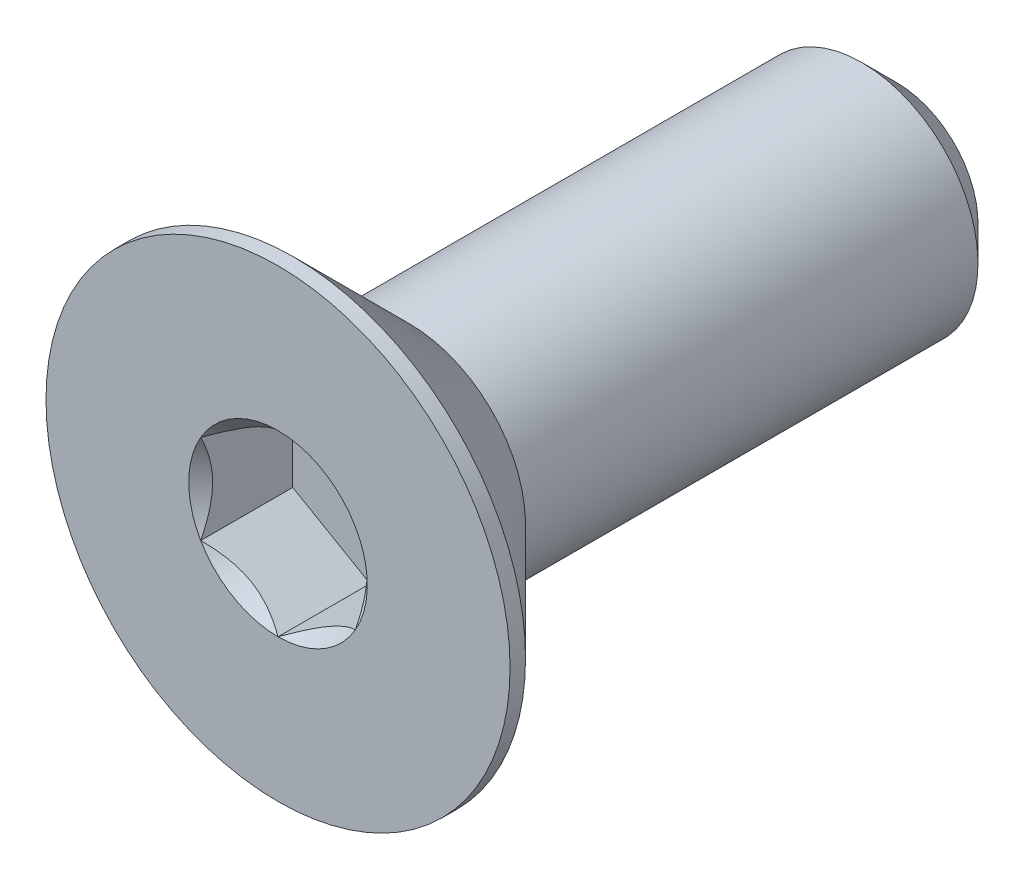
ISO-10303-21;
HEADER;
FILE_DESCRIPTION(('STEP AP214'),'2;1');
FILE_NAME('part.step','',(''),(''),'','','');
FILE_SCHEMA(('AUTOMOTIVE_DESIGN { 1 0 10303 214 1 1 1 1 }'));
ENDSEC;
DATA;
#1=APPLICATION_CONTEXT('core data for automotive mechanical design processes');
#2=APPLICATION_PROTOCOL_DEFINITION('international standard','automotive_design',2000,#1);
#3=PRODUCT_CONTEXT('',#1,'mechanical');
#4=PRODUCT('Part','Part','',(#3));
#5=PRODUCT_RELATED_PRODUCT_CATEGORY('part','',(#4));
#6=PRODUCT_DEFINITION_FORMATION('','',#4);
#7=PRODUCT_DEFINITION_CONTEXT('part definition',#1,'design');
#8=PRODUCT_DEFINITION('design','',#6,#7);
#9=PRODUCT_DEFINITION_SHAPE('','',#8);
#10=(LENGTH_UNIT() NAMED_UNIT(*) SI_UNIT(.MILLI.,.METRE.));
#11=(NAMED_UNIT(*) PLANE_ANGLE_UNIT() SI_UNIT($,.RADIAN.));
#12=(NAMED_UNIT(*) SI_UNIT($,.STERADIAN.) SOLID_ANGLE_UNIT());
#13=UNCERTAINTY_MEASURE_WITH_UNIT(LENGTH_MEASURE(1.E-05),#10,'distance_accuracy_value','');
#14=(GEOMETRIC_REPRESENTATION_CONTEXT(3) GLOBAL_UNCERTAINTY_ASSIGNED_CONTEXT((#13)) GLOBAL_UNIT_ASSIGNED_CONTEXT((#10,
#11,#12)) REPRESENTATION_CONTEXT('',''));
#15=CARTESIAN_POINT('',(0.,0.,0.));
#16=DIRECTION('',(0.,0.,1.));
#17=DIRECTION('',(1.,0.,0.));
#18=AXIS2_PLACEMENT_3D('',#15,#16,#17);
#19=CARTESIAN_POINT('',(0.,0.,-4.));
#20=DIRECTION('',(0.,0.,-1.));
#21=DIRECTION('',(0.,1.,0.));
#22=AXIS2_PLACEMENT_3D('',#19,#20,#21);
#23=CYLINDRICAL_SURFACE('',#22,1.5);
#24=CARTESIAN_POINT('',(0.,0.,2.3));
#25=DIRECTION('',(0.,0.,-1.));
#26=DIRECTION('',(0.,1.,0.));
#27=AXIS2_PLACEMENT_3D('',#24,#25,#26);
#28=CIRCLE('',#27,1.5);
#29=CARTESIAN_POINT('',(0.,1.5,2.3));
#30=VERTEX_POINT('',#29);
#31=EDGE_CURVE('E11',#30,#30,#28,.F.);
#32=ORIENTED_EDGE('',*,*,#31,.F.);
#33=EDGE_LOOP('',(#32));
#34=FACE_BOUND('',#33,.T.);
#35=CARTESIAN_POINT('',(0.,0.,-3.55));
#36=DIRECTION('',(0.,0.,-1.));
#37=DIRECTION('',(0.,1.,0.));
#38=AXIS2_PLACEMENT_3D('',#35,#36,#37);
#39=CIRCLE('',#38,1.5);
#40=CARTESIAN_POINT('',(0.,1.5,-3.55));
#41=VERTEX_POINT('',#40);
#42=EDGE_CURVE('E52',#41,#41,#39,.F.);
#43=ORIENTED_EDGE('',*,*,#42,.T.);
#44=EDGE_LOOP('',(#43));
#45=FACE_BOUND('',#44,.T.);
#46=ADVANCED_FACE('F43',(#34,#45),#23,.T.);
#47=CARTESIAN_POINT('',(0.,1.5,-4.));
#48=DIRECTION('',(0.,0.,-1.));
#49=DIRECTION('',(0.,1.,0.));
#50=AXIS2_PLACEMENT_3D('',#47,#48,#49);
#51=PLANE('',#50);
#52=CARTESIAN_POINT('',(0.,0.,-4.));
#53=DIRECTION('',(0.,0.,-1.));
#54=DIRECTION('',(0.,1.,0.));
#55=AXIS2_PLACEMENT_3D('',#52,#53,#54);
#56=CIRCLE('',#55,1.05);
#57=CARTESIAN_POINT('',(0.,1.05,-4.));
#58=VERTEX_POINT('',#57);
#59=EDGE_CURVE('E170',#58,#58,#56,.T.);
#60=ORIENTED_EDGE('',*,*,#59,.T.);
#61=EDGE_LOOP('',(#60));
#62=FACE_BOUND('',#61,.T.);
#63=ADVANCED_FACE('F182',(#62),#51,.T.);
#64=CARTESIAN_POINT('',(0.,0.,-4.));
#65=DIRECTION('',(0.,0.,1.));
#66=DIRECTION('',(0.,-1.,0.));
#67=AXIS2_PLACEMENT_3D('',#64,#65,#66);
#68=CONICAL_SURFACE('',#67,1.05,0.785398163397446);
#69=ORIENTED_EDGE('',*,*,#42,.F.);
#70=EDGE_LOOP('',(#69));
#71=FACE_BOUND('',#70,.T.);
#72=ORIENTED_EDGE('',*,*,#59,.F.);
#73=EDGE_LOOP('',(#72));
#74=FACE_BOUND('',#73,.T.);
#75=ADVANCED_FACE('F45',(#71,#74),#68,.T.);
#76=CARTESIAN_POINT('',(0.,0.,-4.));
#77=DIRECTION('',(0.,0.,-1.));
#78=DIRECTION('',(0.,1.,0.));
#79=AXIS2_PLACEMENT_3D('',#76,#77,#78);
#80=CYLINDRICAL_SURFACE('',#79,3.);
#81=CARTESIAN_POINT('',(0.,0.,4.));
#82=DIRECTION('',(0.,0.,-1.));
#83=DIRECTION('',(0.,1.,0.));
#84=AXIS2_PLACEMENT_3D('',#81,#82,#83);
#85=CIRCLE('',#84,3.);
#86=CARTESIAN_POINT('',(0.,3.,4.));
#87=VERTEX_POINT('',#86);
#88=EDGE_CURVE('E144',#87,#87,#85,.T.);
#89=ORIENTED_EDGE('',*,*,#88,.T.);
#90=EDGE_LOOP('',(#89));
#91=FACE_BOUND('',#90,.T.);
#92=CARTESIAN_POINT('',(0.,0.,3.8));
#93=DIRECTION('',(0.,0.,-1.));
#94=DIRECTION('',(0.,1.,0.));
#95=AXIS2_PLACEMENT_3D('',#92,#93,#94);
#96=CIRCLE('',#95,3.);
#97=CARTESIAN_POINT('',(0.,3.,3.8));
#98=VERTEX_POINT('',#97);
#99=EDGE_CURVE('E138',#98,#98,#96,.T.);
#100=ORIENTED_EDGE('',*,*,#99,.F.);
#101=EDGE_LOOP('',(#100));
#102=FACE_BOUND('',#101,.T.);
#103=ADVANCED_FACE('F181',(#91,#102),#80,.T.);
#104=CARTESIAN_POINT('',(0.,0.,2.3));
#105=DIRECTION('',(0.,0.,1.));
#106=DIRECTION('',(0.,-1.,0.));
#107=AXIS2_PLACEMENT_3D('',#104,#105,#106);
#108=CONICAL_SURFACE('',#107,1.5,0.78539816339745);
#109=ORIENTED_EDGE('',*,*,#99,.T.);
#110=EDGE_LOOP('',(#109));
#111=FACE_BOUND('',#110,.T.);
#112=ORIENTED_EDGE('',*,*,#31,.T.);
#113=EDGE_LOOP('',(#112));
#114=FACE_BOUND('',#113,.T.);
#115=ADVANCED_FACE('F194',(#111,#114),#108,.T.);
#116=CARTESIAN_POINT('',(0.,0.,4.));
#117=DIRECTION('',(0.,0.,1.));
#118=DIRECTION('',(0.,-1.,0.));
#119=AXIS2_PLACEMENT_3D('',#116,#117,#118);
#120=PLANE('',#119);
#121=CARTESIAN_POINT('',(0.,0.,4.));
#122=DIRECTION('',(0.,0.,1.));
#123=DIRECTION('',(1.,0.,0.));
#124=AXIS2_PLACEMENT_3D('',#121,#122,#123);
#125=CIRCLE('',#124,1.15470053837925);
#126=CARTESIAN_POINT('',(1.,0.577350269189632,4.));
#127=VERTEX_POINT('',#126);
#128=CARTESIAN_POINT('',(0.,1.15470053837926,4.));
#129=VERTEX_POINT('',#128);
#130=EDGE_CURVE('E103',#127,#129,#125,.T.);
#131=ORIENTED_EDGE('',*,*,#130,.F.);
#132=CARTESIAN_POINT('',(0.,0.,4.));
#133=DIRECTION('',(0.,0.,1.));
#134=DIRECTION('',(1.,0.,0.));
#135=AXIS2_PLACEMENT_3D('',#132,#133,#134);
#136=CIRCLE('',#135,1.15470053837925);
#137=CARTESIAN_POINT('',(0.999999999999989,-0.577350269189633,4.));
#138=VERTEX_POINT('',#137);
#139=EDGE_CURVE('E116',#138,#127,#136,.T.);
#140=ORIENTED_EDGE('',*,*,#139,.F.);
#141=CARTESIAN_POINT('',(0.,0.,4.));
#142=DIRECTION('',(0.,0.,1.));
#143=DIRECTION('',(1.,0.,0.));
#144=AXIS2_PLACEMENT_3D('',#141,#142,#143);
#145=CIRCLE('',#144,1.15470053837925);
#146=CARTESIAN_POINT('',(0.,-1.15470053837924,4.));
#147=VERTEX_POINT('',#146);
#148=EDGE_CURVE('E271',#147,#138,#145,.T.);
#149=ORIENTED_EDGE('',*,*,#148,.F.);
#150=CARTESIAN_POINT('',(0.,0.,4.));
#151=DIRECTION('',(0.,0.,1.));
#152=DIRECTION('',(1.,0.,0.));
#153=AXIS2_PLACEMENT_3D('',#150,#151,#152);
#154=CIRCLE('',#153,1.15470053837925);
#155=CARTESIAN_POINT('',(-1.,-0.577350269189614,4.));
#156=VERTEX_POINT('',#155);
#157=EDGE_CURVE('E132',#156,#147,#154,.T.);
#158=ORIENTED_EDGE('',*,*,#157,.F.);
#159=CARTESIAN_POINT('',(0.,0.,4.));
#160=DIRECTION('',(0.,0.,1.));
#161=DIRECTION('',(1.,0.,0.));
#162=AXIS2_PLACEMENT_3D('',#159,#160,#161);
#163=CIRCLE('',#162,1.15470053837925);
#164=CARTESIAN_POINT('',(-1.,0.577350269189624,4.));
#165=VERTEX_POINT('',#164);
#166=EDGE_CURVE('E272',#165,#156,#163,.T.);
#167=ORIENTED_EDGE('',*,*,#166,.F.);
#168=CARTESIAN_POINT('',(0.,0.,4.));
#169=DIRECTION('',(0.,0.,1.));
#170=DIRECTION('',(1.,0.,0.));
#171=AXIS2_PLACEMENT_3D('',#168,#169,#170);
#172=CIRCLE('',#171,1.15470053837925);
#173=EDGE_CURVE('E119',#129,#165,#172,.T.);
#174=ORIENTED_EDGE('',*,*,#173,.F.);
#175=EDGE_LOOP('',(#131,#140,#149,#158,#167,#174));
#176=FACE_BOUND('',#175,.T.);
#177=ORIENTED_EDGE('',*,*,#88,.F.);
#178=EDGE_LOOP('',(#177));
#179=FACE_BOUND('',#178,.T.);
#180=ADVANCED_FACE('F113',(#176,#179),#120,.T.);
#181=CARTESIAN_POINT('',(1.,0.577350269189626,2.81));
#182=DIRECTION('',(0.5,0.866025403784438,0.));
#183=DIRECTION('',(-0.866025403784439,0.5,0.));
#184=AXIS2_PLACEMENT_3D('',#181,#182,#183);
#185=PLANE('',#184);
#186=DIRECTION('',(0.,0.,1.));
#187=VECTOR('',#186,1.);
#188=CARTESIAN_POINT('',(1.,0.577350269189626,2.81));
#189=LINE('',#188,#187);
#190=CARTESIAN_POINT('',(1.,0.577350269189626,2.81));
#191=VERTEX_POINT('',#190);
#192=EDGE_CURVE('E59',#191,#127,#189,.T.);
#193=ORIENTED_EDGE('',*,*,#192,.T.);
#194=CARTESIAN_POINT('',(-0.000199999999999858,1.15481600843309,4.00011548737261));
#195=CARTESIAN_POINT('',(0.0341825950071804,1.13496520795026,3.98027793082573));
#196=CARTESIAN_POINT('',(0.0691401181398244,1.11478247255942,3.96160502063888));
#197=CARTESIAN_POINT('',(0.140422802956089,1.07362739529219,3.92741474272315));
#198=CARTESIAN_POINT('',(0.176754750528983,1.0526511355808,3.91191640902345));
#199=CARTESIAN_POINT('',(0.25001661380331,1.01035337909803,3.88536730714226));
#200=CARTESIAN_POINT('',(0.286927851445413,0.989042666109242,3.87424977399692));
#201=CARTESIAN_POINT('',(0.361562729310857,0.945952199282693,3.85711986577618));
#202=CARTESIAN_POINT('',(0.399284088108633,0.924173762626598,3.85109469746667));
#203=CARTESIAN_POINT('',(0.464292198417931,0.886641312640016,3.84566055496749));
#204=CARTESIAN_POINT('',(0.491494371528169,0.870936130672278,3.84485693831673));
#205=CARTESIAN_POINT('',(0.545846040669109,0.839556179862851,3.84620669941688));
#206=CARTESIAN_POINT('',(0.572995523754872,0.823881418494926,3.84836072954719));
#207=CARTESIAN_POINT('',(0.654056277326956,0.777080970599369,3.85911697212847));
#208=CARTESIAN_POINT('',(0.707564140978423,0.746188191116433,3.87201455641535));
#209=CARTESIAN_POINT('',(0.801476065143428,0.691968116419652,3.90314073060217));
#210=CARTESIAN_POINT('',(0.842320523671831,0.668386557293374,3.91973779770183));
#211=CARTESIAN_POINT('',(0.922409637381942,0.622147085933683,3.95712492468529));
#212=CARTESIAN_POINT('',(0.961659010870436,0.599486449584576,3.9779013418174));
#213=CARTESIAN_POINT('',(1.0002,0.577234799135789,4.00011548737261));
#214=B_SPLINE_CURVE_WITH_KNOTS('',3,(#194,#195,#196,#197,#198,#199,#200,#201,#202,#203,#204,
#205,#206,#207,#208,#209,#210,#211,#212,#213),.UNSPECIFIED.,.F.,.F.,(4,2,2,2,2,2,2,2,2,4),(0.,
0.133237676828559,0.267252229834489,0.399137076269298,0.530689603280765,0.624814864263842,
0.718960890149129,0.907306626112092,1.05710100361789,1.20641411519286),.UNSPECIFIED.);
#215=EDGE_CURVE('E100',#129,#127,#214,.T.);
#216=ORIENTED_EDGE('',*,*,#215,.F.);
#217=DIRECTION('',(0.,0.,1.));
#218=VECTOR('',#217,1.);
#219=CARTESIAN_POINT('',(0.,1.15470053837925,2.81));
#220=LINE('',#219,#218);
#221=CARTESIAN_POINT('',(0.,1.15470053837925,2.81));
#222=VERTEX_POINT('',#221);
#223=EDGE_CURVE('E164',#222,#129,#220,.T.);
#224=ORIENTED_EDGE('',*,*,#223,.F.);
#225=DIRECTION('',(-0.866025403784439,0.5,0.));
#226=VECTOR('',#225,1.);
#227=CARTESIAN_POINT('',(1.,0.577350269189626,2.81));
#228=LINE('',#227,#226);
#229=EDGE_CURVE('E128',#191,#222,#228,.T.);
#230=ORIENTED_EDGE('',*,*,#229,.F.);
#231=EDGE_LOOP('',(#193,#216,#224,#230));
#232=FACE_BOUND('',#231,.T.);
#233=ADVANCED_FACE('F134',(#232),#185,.F.);
#234=CARTESIAN_POINT('',(1.,-0.577350269189627,2.81));
#235=DIRECTION('',(1.,0.,0.));
#236=DIRECTION('',(0.,0.,-1.));
#237=AXIS2_PLACEMENT_3D('',#234,#235,#236);
#238=PLANE('',#237);
#239=DIRECTION('',(0.,0.,1.));
#240=VECTOR('',#239,1.);
#241=CARTESIAN_POINT('',(1.,-0.577350269189627,2.81));
#242=LINE('',#241,#240);
#243=CARTESIAN_POINT('',(1.,-0.577350269189627,2.81));
#244=VERTEX_POINT('',#243);
#245=EDGE_CURVE('E67',#244,#138,#242,.T.);
#246=ORIENTED_EDGE('',*,*,#245,.T.);
#247=CARTESIAN_POINT('',(1.,-1.15147208646463,4.37038567751387));
#248=CARTESIAN_POINT('',(1.,-1.12343447988553,4.34921991987373));
#249=CARTESIAN_POINT('',(1.,-1.09524064850698,4.32826169217592));
#250=CARTESIAN_POINT('',(1.,-1.03847715644377,4.28684602223563));
#251=CARTESIAN_POINT('',(1.,-1.00990740382976,4.26638870612367));
#252=CARTESIAN_POINT('',(1.,-0.923120894333482,4.20560479495452));
#253=CARTESIAN_POINT('',(1.,-0.864253173759065,4.16619222896141));
#254=CARTESIAN_POINT('',(1.,-0.740809858258049,4.08882066420021));
#255=CARTESIAN_POINT('',(1.,-0.676100255137809,4.05107303911435));
#256=CARTESIAN_POINT('',(1.,-0.543448939049125,3.9820245875513));
#257=CARTESIAN_POINT('',(1.,-0.475519112027778,3.95070202784687));
#258=CARTESIAN_POINT('',(1.,-0.373555850333527,3.9123817788838));
#259=CARTESIAN_POINT('',(1.,-0.341031989670906,3.90138359164216));
#260=CARTESIAN_POINT('',(1.,-0.275199079052291,3.88199834214736));
#261=CARTESIAN_POINT('',(1.,-0.24188997517393,3.8736114597767));
#262=CARTESIAN_POINT('',(1.,-0.17524751704299,3.86002522071902));
#263=CARTESIAN_POINT('',(1.,-0.141925568218172,3.85477079076797));
#264=CARTESIAN_POINT('',(1.,-0.0749144362322751,3.84754868657089));
#265=CARTESIAN_POINT('',(1.,-0.0412251978501576,3.84558151361051));
#266=CARTESIAN_POINT('',(1.,0.0249580992634257,3.84508319839316));
#267=CARTESIAN_POINT('',(1.,0.0574512826460442,3.84643026788864));
#268=CARTESIAN_POINT('',(1.,0.122148505701872,3.85221648449899));
#269=CARTESIAN_POINT('',(1.,0.154352610132932,3.85665492066154));
#270=CARTESIAN_POINT('',(1.,0.218799898867646,3.8684568301452));
#271=CARTESIAN_POINT('',(1.,0.25103374326896,3.87587054103851));
#272=CARTESIAN_POINT('',(1.,0.314797132354926,3.89322894249868));
#273=CARTESIAN_POINT('',(1.,0.346326735731011,3.90317342128883));
#274=CARTESIAN_POINT('',(1.,0.445594187730212,3.93822348255434));
#275=CARTESIAN_POINT('',(1.,0.511919139476043,3.96732085835672));
#276=CARTESIAN_POINT('',(1.,0.641453244657538,4.0320153296865));
#277=CARTESIAN_POINT('',(1.,0.70465013312635,4.06763577671524));
#278=CARTESIAN_POINT('',(1.,0.825428490174992,4.14112390134693));
#279=CARTESIAN_POINT('',(1.,0.883132947867689,4.17879194713546));
#280=CARTESIAN_POINT('',(1.,0.96814885370457,4.23702285294316));
#281=CARTESIAN_POINT('',(1.,0.996120570380289,4.25663847576285));
#282=CARTESIAN_POINT('',(1.,1.05168177729902,4.29638851706127));
#283=CARTESIAN_POINT('',(1.,1.07927136997701,4.31652279219883));
#284=CARTESIAN_POINT('',(1.,1.1067018534633,4.33687211907297));
#285=B_SPLINE_CURVE_WITH_KNOTS('',3,(#247,#248,#249,#250,#251,#252,#253,#254,#255,#256,#257,
#258,#259,#260,#261,#262,#263,#264,#265,#266,#267,#268,#269,#270,#271,#272,#273,#274,#275,#276,
#277,#278,#279,#280,#281,#282,#283,#284),.UNSPECIFIED.,.F.,.F.,(4,2,2,2,2,2,2,2,2,2,2,2,2,2,2,2,
2,2,4),(0.,0.105386459083291,0.210799187330127,0.423233611565475,0.647793540908513,
0.871580877738623,0.974493074181435,1.07741235827203,1.17846428203206,1.27953161415764,
1.37694086739612,1.4743277258541,1.57343322804295,1.67253043972853,1.88917353996829,
2.10660791038815,2.31323734249845,2.41572589232046,2.51818641476505),.UNSPECIFIED.);
#286=EDGE_CURVE('E126',#127,#138,#285,.F.);
#287=ORIENTED_EDGE('',*,*,#286,.F.);
#288=ORIENTED_EDGE('',*,*,#192,.F.);
#289=DIRECTION('',(0.,1.,0.));
#290=VECTOR('',#289,1.);
#291=CARTESIAN_POINT('',(1.,-0.577350269189627,2.81));
#292=LINE('',#291,#290);
#293=EDGE_CURVE('E150',#244,#191,#292,.T.);
#294=ORIENTED_EDGE('',*,*,#293,.F.);
#295=EDGE_LOOP('',(#246,#287,#288,#294));
#296=FACE_BOUND('',#295,.T.);
#297=ADVANCED_FACE('F130',(#296),#238,.F.);
#298=CARTESIAN_POINT('',(0.,-1.15470053837925,2.81));
#299=DIRECTION('',(0.5,-0.866025403784439,0.));
#300=DIRECTION('',(0.866025403784439,0.5,0.));
#301=AXIS2_PLACEMENT_3D('',#298,#299,#300);
#302=PLANE('',#301);
#303=DIRECTION('',(0.,0.,1.));
#304=VECTOR('',#303,1.);
#305=CARTESIAN_POINT('',(0.,-1.15470053837925,2.81));
#306=LINE('',#305,#304);
#307=CARTESIAN_POINT('',(0.,-1.15470053837925,2.81));
#308=VERTEX_POINT('',#307);
#309=EDGE_CURVE('E147',#308,#147,#306,.T.);
#310=ORIENTED_EDGE('',*,*,#309,.T.);
#311=CARTESIAN_POINT('',(1.0002,-0.577234799135789,4.00011548737262));
#312=CARTESIAN_POINT('',(0.965817404992819,-0.597085599618622,3.98027793082574));
#313=CARTESIAN_POINT('',(0.930859881860175,-0.617268335009457,3.9616050206389));
#314=CARTESIAN_POINT('',(0.859577197043911,-0.658423412276686,3.92741474272317));
#315=CARTESIAN_POINT('',(0.823245249471016,-0.67939967198808,3.91191640902347));
#316=CARTESIAN_POINT('',(0.74998338619669,-0.721697428470846,3.88536730714227));
#317=CARTESIAN_POINT('',(0.713072148554587,-0.743008141459637,3.87424977399693));
#318=CARTESIAN_POINT('',(0.638437270689142,-0.786098608286186,3.85711986577619));
#319=CARTESIAN_POINT('',(0.600715911891366,-0.80787704494228,3.85109469746668));
#320=CARTESIAN_POINT('',(0.535707801582068,-0.845409494928862,3.8456605549675));
#321=CARTESIAN_POINT('',(0.508505628471829,-0.861114676896601,3.84485693831674));
#322=CARTESIAN_POINT('',(0.454153959330889,-0.892494627706029,3.8462066994169));
#323=CARTESIAN_POINT('',(0.427004476245125,-0.908169389073954,3.84836072954721));
#324=CARTESIAN_POINT('',(0.34594372267304,-0.954969836969511,3.85911697212848));
#325=CARTESIAN_POINT('',(0.292435859021573,-0.985862616452447,3.87201455641537));
#326=CARTESIAN_POINT('',(0.198523934856568,-1.04008269114923,3.90314073060219));
#327=CARTESIAN_POINT('',(0.157679476328166,-1.06366425027551,3.91973779770185));
#328=CARTESIAN_POINT('',(0.0775903626180562,-1.1099037216352,3.9571249246853));
#329=CARTESIAN_POINT('',(0.0383409891295622,-1.1325643579843,3.97790134181741));
#330=CARTESIAN_POINT('',(-0.000199999999999848,-1.15481600843309,4.00011548737262));
#331=B_SPLINE_CURVE_WITH_KNOTS('',3,(#311,#312,#313,#314,#315,#316,#317,#318,#319,#320,#321,
#322,#323,#324,#325,#326,#327,#328,#329,#330),.UNSPECIFIED.,.F.,.F.,(4,2,2,2,2,2,2,2,2,4),(0.,
0.133237676828558,0.267252229834488,0.399137076269297,0.530689603280765,0.624814864263843,
0.718960890149131,0.907306626112096,1.05710100361789,1.20641411519286),.UNSPECIFIED.);
#332=EDGE_CURVE('E268',#138,#147,#331,.T.);
#333=ORIENTED_EDGE('',*,*,#332,.F.);
#334=ORIENTED_EDGE('',*,*,#245,.F.);
#335=DIRECTION('',(0.866025403784439,0.5,0.));
#336=VECTOR('',#335,1.);
#337=CARTESIAN_POINT('',(0.,-1.15470053837925,2.81));
#338=LINE('',#337,#336);
#339=EDGE_CURVE('E258',#308,#244,#338,.T.);
#340=ORIENTED_EDGE('',*,*,#339,.F.);
#341=EDGE_LOOP('',(#310,#333,#334,#340));
#342=FACE_BOUND('',#341,.T.);
#343=ADVANCED_FACE('F217',(#342),#302,.F.);
#344=CARTESIAN_POINT('',(-1.,-0.577350269189626,2.81));
#345=DIRECTION('',(-0.5,-0.866025403784439,0.));
#346=DIRECTION('',(0.866025403784439,-0.5,0.));
#347=AXIS2_PLACEMENT_3D('',#344,#345,#346);
#348=PLANE('',#347);
#349=DIRECTION('',(0.,0.,1.));
#350=VECTOR('',#349,1.);
#351=CARTESIAN_POINT('',(-1.,-0.577350269189626,2.81));
#352=LINE('',#351,#350);
#353=CARTESIAN_POINT('',(-1.,-0.577350269189626,2.81));
#354=VERTEX_POINT('',#353);
#355=EDGE_CURVE('E156',#354,#156,#352,.T.);
#356=ORIENTED_EDGE('',*,*,#355,.T.);
#357=CARTESIAN_POINT('',(0.000199999999999887,-1.15481600843309,4.00011548737262));
#358=CARTESIAN_POINT('',(-0.0341825950071811,-1.13496520795026,3.98027793082574));
#359=CARTESIAN_POINT('',(-0.0691401181398256,-1.11478247255942,3.9616050206389));
#360=CARTESIAN_POINT('',(-0.140422802956091,-1.07362739529219,3.92741474272317));
#361=CARTESIAN_POINT('',(-0.176754750528986,-1.0526511355808,3.91191640902347));
#362=CARTESIAN_POINT('',(-0.250016613803313,-1.01035337909803,3.88536730714227));
#363=CARTESIAN_POINT('',(-0.286927851445417,-0.98904266610924,3.87424977399694));
#364=CARTESIAN_POINT('',(-0.361562729310862,-0.94595219928269,3.85711986577619));
#365=CARTESIAN_POINT('',(-0.399284088108639,-0.924173762626595,3.85109469746668));
#366=CARTESIAN_POINT('',(-0.464292198417937,-0.886641312640012,3.8456605549675));
#367=CARTESIAN_POINT('',(-0.491494371528176,-0.870936130672273,3.84485693831674));
#368=CARTESIAN_POINT('',(-0.545846040669117,-0.839556179862846,3.8462066994169));
#369=CARTESIAN_POINT('',(-0.57299552375488,-0.823881418494921,3.84836072954721));
#370=CARTESIAN_POINT('',(-0.654056277326966,-0.777080970599364,3.85911697212848));
#371=CARTESIAN_POINT('',(-0.707564140978433,-0.746188191116427,3.87201455641537));
#372=CARTESIAN_POINT('',(-0.801476065143437,-0.691968116419646,3.90314073060219));
#373=CARTESIAN_POINT('',(-0.842320523671838,-0.668386557293369,3.91973779770185));
#374=CARTESIAN_POINT('',(-0.922409637381946,-0.62214708593368,3.9571249246853));
#375=CARTESIAN_POINT('',(-0.961659010870439,-0.599486449584575,3.97790134181741));
#376=CARTESIAN_POINT('',(-1.0002,-0.577234799135788,4.00011548737262));
#377=B_SPLINE_CURVE_WITH_KNOTS('',3,(#357,#358,#359,#360,#361,#362,#363,#364,#365,#366,#367,
#368,#369,#370,#371,#372,#373,#374,#375,#376),.UNSPECIFIED.,.F.,.F.,(4,2,2,2,2,2,2,2,2,4),(0.,
0.13323767682856,0.267252229834492,0.399137076269303,0.530689603280773,0.624814864263851,
0.718960890149139,0.907306626112105,1.0571010036179,1.20641411519286),.UNSPECIFIED.);
#378=EDGE_CURVE('E235',#147,#156,#377,.T.);
#379=ORIENTED_EDGE('',*,*,#378,.F.);
#380=ORIENTED_EDGE('',*,*,#309,.F.);
#381=DIRECTION('',(0.866025403784439,-0.5,0.));
#382=VECTOR('',#381,1.);
#383=CARTESIAN_POINT('',(-1.,-0.577350269189626,2.81));
#384=LINE('',#383,#382);
#385=EDGE_CURVE('E255',#354,#308,#384,.T.);
#386=ORIENTED_EDGE('',*,*,#385,.F.);
#387=EDGE_LOOP('',(#356,#379,#380,#386));
#388=FACE_BOUND('',#387,.T.);
#389=ADVANCED_FACE('F213',(#388),#348,.F.);
#390=CARTESIAN_POINT('',(-1.,0.577350269189626,2.81));
#391=DIRECTION('',(-1.,0.,0.));
#392=DIRECTION('',(0.,-1.,0.));
#393=AXIS2_PLACEMENT_3D('',#390,#391,#392);
#394=PLANE('',#393);
#395=DIRECTION('',(0.,0.,1.));
#396=VECTOR('',#395,1.);
#397=CARTESIAN_POINT('',(-1.,0.577350269189626,2.81));
#398=LINE('',#397,#396);
#399=CARTESIAN_POINT('',(-1.,0.577350269189626,2.81));
#400=VERTEX_POINT('',#399);
#401=EDGE_CURVE('E160',#400,#165,#398,.T.);
#402=ORIENTED_EDGE('',*,*,#401,.T.);
#403=CARTESIAN_POINT('',(-1.,-1.15147208646462,4.37038567751387));
#404=CARTESIAN_POINT('',(-1.,-1.12343447988552,4.34921991987372));
#405=CARTESIAN_POINT('',(-1.,-1.09524064850698,4.32826169217592));
#406=CARTESIAN_POINT('',(-1.,-1.03847715644377,4.28684602223563));
#407=CARTESIAN_POINT('',(-1.,-1.00990740382975,4.26638870612367));
#408=CARTESIAN_POINT('',(-1.,-0.92312089433348,4.20560479495452));
#409=CARTESIAN_POINT('',(-1.,-0.864253173759062,4.16619222896141));
#410=CARTESIAN_POINT('',(-1.,-0.740809858258047,4.08882066420021));
#411=CARTESIAN_POINT('',(-1.,-0.676100255137807,4.05107303911435));
#412=CARTESIAN_POINT('',(-1.,-0.543448939049123,3.9820245875513));
#413=CARTESIAN_POINT('',(-1.,-0.475519112027777,3.95070202784687));
#414=CARTESIAN_POINT('',(-1.,-0.373555850333526,3.9123817788838));
#415=CARTESIAN_POINT('',(-1.,-0.341031989670905,3.90138359164216));
#416=CARTESIAN_POINT('',(-1.,-0.27519907905229,3.88199834214736));
#417=CARTESIAN_POINT('',(-1.,-0.241889975173929,3.8736114597767));
#418=CARTESIAN_POINT('',(-1.,-0.175247517042989,3.86002522071902));
#419=CARTESIAN_POINT('',(-1.,-0.141925568218171,3.85477079076797));
#420=CARTESIAN_POINT('',(-1.,-0.0749144362322745,3.84754868657089));
#421=CARTESIAN_POINT('',(-1.,-0.0412251978501571,3.84558151361051));
#422=CARTESIAN_POINT('',(-1.,0.0249580992634261,3.84508319839316));
#423=CARTESIAN_POINT('',(-1.,0.0574512826460445,3.84643026788864));
#424=CARTESIAN_POINT('',(-1.,0.122148505701872,3.85221648449899));
#425=CARTESIAN_POINT('',(-1.,0.154352610132932,3.85665492066154));
#426=CARTESIAN_POINT('',(-1.,0.218799898867646,3.8684568301452));
#427=CARTESIAN_POINT('',(-1.,0.25103374326896,3.87587054103851));
#428=CARTESIAN_POINT('',(-1.,0.314797132354926,3.89322894249868));
#429=CARTESIAN_POINT('',(-1.,0.346326735731012,3.90317342128883));
#430=CARTESIAN_POINT('',(-1.,0.445594187730212,3.93822348255434));
#431=CARTESIAN_POINT('',(-1.,0.511919139476043,3.96732085835672));
#432=CARTESIAN_POINT('',(-1.,0.641453244657538,4.03201532968651));
#433=CARTESIAN_POINT('',(-1.,0.70465013312635,4.06763577671524));
#434=CARTESIAN_POINT('',(-1.,0.825428490174992,4.14112390134693));
#435=CARTESIAN_POINT('',(-1.,0.88313294786769,4.17879194713546));
#436=CARTESIAN_POINT('',(-1.,0.96814885370457,4.23702285294316));
#437=CARTESIAN_POINT('',(-1.,0.99612057038029,4.25663847576285));
#438=CARTESIAN_POINT('',(-1.,1.05168177729902,4.29638851706127));
#439=CARTESIAN_POINT('',(-1.,1.07927136997701,4.31652279219883));
#440=CARTESIAN_POINT('',(-1.,1.1067018534633,4.33687211907297));
#441=B_SPLINE_CURVE_WITH_KNOTS('',3,(#403,#404,#405,#406,#407,#408,#409,#410,#411,#412,#413,
#414,#415,#416,#417,#418,#419,#420,#421,#422,#423,#424,#425,#426,#427,#428,#429,#430,#431,#432,
#433,#434,#435,#436,#437,#438,#439,#440),.UNSPECIFIED.,.F.,.F.,(4,2,2,2,2,2,2,2,2,2,2,2,2,2,2,2,
2,2,4),(0.,0.105386459083292,0.210799187330127,0.423233611565474,0.647793540908512,
0.871580877738621,0.974493074181433,1.07741235827202,1.17846428203206,1.27953161415764,
1.37694086739612,1.47432772585409,1.57343322804295,1.67253043972853,1.88917353996829,
2.10660791038814,2.31323734249845,2.41572589232046,2.51818641476504),.UNSPECIFIED.);
#442=EDGE_CURVE('E107',#156,#165,#441,.T.);
#443=ORIENTED_EDGE('',*,*,#442,.F.);
#444=ORIENTED_EDGE('',*,*,#355,.F.);
#445=DIRECTION('',(0.,-1.,0.));
#446=VECTOR('',#445,1.);
#447=CARTESIAN_POINT('',(-1.,0.577350269189626,2.81));
#448=LINE('',#447,#446);
#449=EDGE_CURVE('E251',#400,#354,#448,.T.);
#450=ORIENTED_EDGE('',*,*,#449,.F.);
#451=EDGE_LOOP('',(#402,#443,#444,#450));
#452=FACE_BOUND('',#451,.T.);
#453=ADVANCED_FACE('F209',(#452),#394,.F.);
#454=CARTESIAN_POINT('',(0.,1.15470053837925,2.81));
#455=DIRECTION('',(-0.5,0.866025403784439,0.));
#456=DIRECTION('',(-0.866025403784439,-0.5,0.));
#457=AXIS2_PLACEMENT_3D('',#454,#455,#456);
#458=PLANE('',#457);
#459=ORIENTED_EDGE('',*,*,#223,.T.);
#460=CARTESIAN_POINT('',(-1.0002,0.577234799135788,4.00011548737261));
#461=CARTESIAN_POINT('',(-0.965817404992819,0.597085599618622,3.98027793082573));
#462=CARTESIAN_POINT('',(-0.930859881860175,0.617268335009457,3.96160502063889));
#463=CARTESIAN_POINT('',(-0.859577197043909,0.658423412276687,3.92741474272315));
#464=CARTESIAN_POINT('',(-0.823245249471015,0.679399671988081,3.91191640902345));
#465=CARTESIAN_POINT('',(-0.749983386196687,0.721697428470848,3.88536730714226));
#466=CARTESIAN_POINT('',(-0.713072148554584,0.743008141459638,3.87424977399692));
#467=CARTESIAN_POINT('',(-0.638437270689138,0.786098608286188,3.85711986577618));
#468=CARTESIAN_POINT('',(-0.600715911891362,0.807877044942283,3.85109469746667));
#469=CARTESIAN_POINT('',(-0.535707801582064,0.845409494928865,3.84566055496749));
#470=CARTESIAN_POINT('',(-0.508505628471825,0.861114676896604,3.84485693831673));
#471=CARTESIAN_POINT('',(-0.454153959330886,0.892494627706031,3.84620669941688));
#472=CARTESIAN_POINT('',(-0.427004476245122,0.908169389073955,3.84836072954719));
#473=CARTESIAN_POINT('',(-0.345943722673038,0.954969836969512,3.85911697212847));
#474=CARTESIAN_POINT('',(-0.292435859021571,0.985862616452448,3.87201455641535));
#475=CARTESIAN_POINT('',(-0.198523934856568,1.04008269114923,3.90314073060217));
#476=CARTESIAN_POINT('',(-0.157679476328165,1.06366425027551,3.91973779770183));
#477=CARTESIAN_POINT('',(-0.077590362618056,1.1099037216352,3.95712492468529));
#478=CARTESIAN_POINT('',(-0.0383409891295618,1.1325643579843,3.9779013418174));
#479=CARTESIAN_POINT('',(0.000200000000000454,1.15481600843309,4.00011548737261));
#480=B_SPLINE_CURVE_WITH_KNOTS('',3,(#460,#461,#462,#463,#464,#465,#466,#467,#468,#469,#470,
#471,#472,#473,#474,#475,#476,#477,#478,#479),.UNSPECIFIED.,.F.,.F.,(4,2,2,2,2,2,2,2,2,4),(0.,
0.13323767682856,0.267252229834492,0.399137076269303,0.530689603280772,0.624814864263849,
0.718960890149136,0.907306626112099,1.05710100361789,1.20641411519286),.UNSPECIFIED.);
#481=EDGE_CURVE('E264',#165,#129,#480,.T.);
#482=ORIENTED_EDGE('',*,*,#481,.F.);
#483=ORIENTED_EDGE('',*,*,#401,.F.);
#484=DIRECTION('',(-0.866025403784439,-0.5,0.));
#485=VECTOR('',#484,1.);
#486=CARTESIAN_POINT('',(0.,1.15470053837925,2.81));
#487=LINE('',#486,#485);
#488=EDGE_CURVE('E247',#222,#400,#487,.T.);
#489=ORIENTED_EDGE('',*,*,#488,.F.);
#490=EDGE_LOOP('',(#459,#482,#483,#489));
#491=FACE_BOUND('',#490,.T.);
#492=ADVANCED_FACE('F205',(#491),#458,.F.);
#493=CARTESIAN_POINT('',(0.,0.,2.81));
#494=DIRECTION('',(0.,0.,1.));
#495=DIRECTION('',(1.,0.,0.));
#496=AXIS2_PLACEMENT_3D('',#493,#494,#495);
#497=PLANE('',#496);
#498=ORIENTED_EDGE('',*,*,#229,.T.);
#499=ORIENTED_EDGE('',*,*,#488,.T.);
#500=ORIENTED_EDGE('',*,*,#449,.T.);
#501=ORIENTED_EDGE('',*,*,#385,.T.);
#502=ORIENTED_EDGE('',*,*,#339,.T.);
#503=ORIENTED_EDGE('',*,*,#293,.T.);
#504=EDGE_LOOP('',(#498,#499,#500,#501,#502,#503));
#505=FACE_BOUND('',#504,.T.);
#506=ADVANCED_FACE('F208',(#505),#497,.T.);
#507=CARTESIAN_POINT('',(0.,0.,4.));
#508=DIRECTION('',(0.,0.,1.));
#509=DIRECTION('',(1.,0.,0.));
#510=AXIS2_PLACEMENT_3D('',#507,#508,#509);
#511=CONICAL_SURFACE('',#510,1.15470053837925,0.78539816339745);
#512=ORIENTED_EDGE('',*,*,#481,.T.);
#513=ORIENTED_EDGE('',*,*,#173,.T.);
#514=EDGE_LOOP('',(#512,#513));
#515=FACE_BOUND('',#514,.T.);
#516=ADVANCED_FACE('F225',(#515),#511,.F.);
#517=CARTESIAN_POINT('',(0.,0.,4.));
#518=DIRECTION('',(0.,0.,1.));
#519=DIRECTION('',(1.,0.,0.));
#520=AXIS2_PLACEMENT_3D('',#517,#518,#519);
#521=CONICAL_SURFACE('',#520,1.15470053837925,0.78539816339745);
#522=ORIENTED_EDGE('',*,*,#378,.T.);
#523=ORIENTED_EDGE('',*,*,#157,.T.);
#524=EDGE_LOOP('',(#522,#523));
#525=FACE_BOUND('',#524,.T.);
#526=ADVANCED_FACE('F227',(#525),#521,.F.);
#527=CARTESIAN_POINT('',(0.,0.,4.));
#528=DIRECTION('',(0.,0.,1.));
#529=DIRECTION('',(1.,0.,0.));
#530=AXIS2_PLACEMENT_3D('',#527,#528,#529);
#531=CONICAL_SURFACE('',#530,1.15470053837925,0.78539816339745);
#532=ORIENTED_EDGE('',*,*,#286,.T.);
#533=ORIENTED_EDGE('',*,*,#139,.T.);
#534=EDGE_LOOP('',(#532,#533));
#535=FACE_BOUND('',#534,.T.);
#536=ADVANCED_FACE('F125',(#535),#531,.F.);
#537=CARTESIAN_POINT('',(0.,0.,4.));
#538=DIRECTION('',(0.,0.,1.));
#539=DIRECTION('',(1.,0.,0.));
#540=AXIS2_PLACEMENT_3D('',#537,#538,#539);
#541=CONICAL_SURFACE('',#540,1.15470053837925,0.78539816339745);
#542=ORIENTED_EDGE('',*,*,#332,.T.);
#543=ORIENTED_EDGE('',*,*,#148,.T.);
#544=EDGE_LOOP('',(#542,#543));
#545=FACE_BOUND('',#544,.T.);
#546=ADVANCED_FACE('F285',(#545),#541,.F.);
#547=CARTESIAN_POINT('',(0.,0.,4.));
#548=DIRECTION('',(0.,0.,1.));
#549=DIRECTION('',(1.,0.,0.));
#550=AXIS2_PLACEMENT_3D('',#547,#548,#549);
#551=CONICAL_SURFACE('',#550,1.15470053837925,0.78539816339745);
#552=ORIENTED_EDGE('',*,*,#442,.T.);
#553=ORIENTED_EDGE('',*,*,#166,.T.);
#554=EDGE_LOOP('',(#552,#553));
#555=FACE_BOUND('',#554,.T.);
#556=ADVANCED_FACE('F290',(#555),#551,.F.);
#557=CARTESIAN_POINT('',(0.,0.,4.));
#558=DIRECTION('',(0.,0.,1.));
#559=DIRECTION('',(1.,0.,0.));
#560=AXIS2_PLACEMENT_3D('',#557,#558,#559);
#561=CONICAL_SURFACE('',#560,1.15470053837925,0.78539816339745);
#562=ORIENTED_EDGE('',*,*,#215,.T.);
#563=ORIENTED_EDGE('',*,*,#130,.T.);
#564=EDGE_LOOP('',(#562,#563));
#565=FACE_BOUND('',#564,.T.);
#566=ADVANCED_FACE('F102',(#565),#561,.F.);
#567=CLOSED_SHELL('',(#46,#63,#75,#103,#115,#180,#233,#297,#343,#389,#453,#492,#506,#516,#526,
#536,#546,#556,#566));
#568=MANIFOLD_SOLID_BREP('B2',#567);
#569=ADVANCED_BREP_SHAPE_REPRESENTATION('',(#18,#568),#14);
#570=SHAPE_DEFINITION_REPRESENTATION(#9,#569);
ENDSEC;
END-ISO-10303-21;
